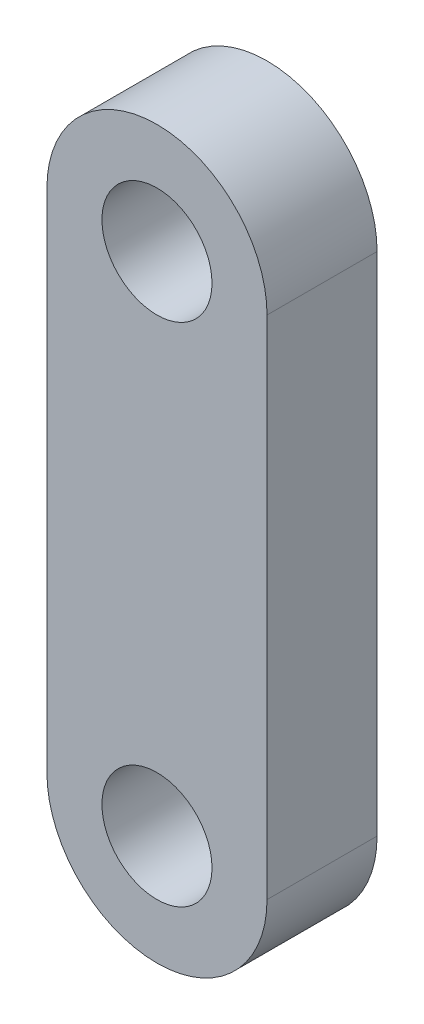
ISO-10303-21;
HEADER;
FILE_DESCRIPTION(('STEP AP214'),'2;1');
FILE_NAME('part.step','',(''),(''),'','','');
FILE_SCHEMA(('AUTOMOTIVE_DESIGN { 1 0 10303 214 1 1 1 1 }'));
ENDSEC;
DATA;
#1=APPLICATION_CONTEXT('core data for automotive mechanical design processes');
#2=APPLICATION_PROTOCOL_DEFINITION('international standard','automotive_design',2000,#1);
#3=PRODUCT_CONTEXT('',#1,'mechanical');
#4=PRODUCT('Part','Part','',(#3));
#5=PRODUCT_RELATED_PRODUCT_CATEGORY('part','',(#4));
#6=PRODUCT_DEFINITION_FORMATION('','',#4);
#7=PRODUCT_DEFINITION_CONTEXT('part definition',#1,'design');
#8=PRODUCT_DEFINITION('design','',#6,#7);
#9=PRODUCT_DEFINITION_SHAPE('','',#8);
#10=(LENGTH_UNIT() NAMED_UNIT(*) SI_UNIT(.MILLI.,.METRE.));
#11=(NAMED_UNIT(*) PLANE_ANGLE_UNIT() SI_UNIT($,.RADIAN.));
#12=(NAMED_UNIT(*) SI_UNIT($,.STERADIAN.) SOLID_ANGLE_UNIT());
#13=UNCERTAINTY_MEASURE_WITH_UNIT(LENGTH_MEASURE(1.E-05),#10,'distance_accuracy_value','');
#14=(GEOMETRIC_REPRESENTATION_CONTEXT(3) GLOBAL_UNCERTAINTY_ASSIGNED_CONTEXT((#13)) GLOBAL_UNIT_ASSIGNED_CONTEXT((#10,
#11,#12)) REPRESENTATION_CONTEXT('',''));
#15=CARTESIAN_POINT('',(0.,0.,0.));
#16=DIRECTION('',(0.,0.,1.));
#17=DIRECTION('',(1.,0.,0.));
#18=AXIS2_PLACEMENT_3D('',#15,#16,#17);
#19=CARTESIAN_POINT('',(0.,0.,2.5));
#20=DIRECTION('',(0.,0.,-1.));
#21=DIRECTION('',(-1.,0.,0.));
#22=AXIS2_PLACEMENT_3D('',#19,#20,#21);
#23=PLANE('',#22);
#24=CARTESIAN_POINT('',(0.,0.,2.5));
#25=DIRECTION('',(0.,0.,1.));
#26=DIRECTION('',(-1.,0.,0.));
#27=AXIS2_PLACEMENT_3D('',#24,#25,#26);
#28=CIRCLE('',#27,5.);
#29=CARTESIAN_POINT('',(-5.,0.,2.5));
#30=VERTEX_POINT('',#29);
#31=CARTESIAN_POINT('',(5.,0.,2.5));
#32=VERTEX_POINT('',#31);
#33=EDGE_CURVE('E87',#30,#32,#28,.T.);
#34=ORIENTED_EDGE('',*,*,#33,.T.);
#35=DIRECTION('',(0.,1.,0.));
#36=VECTOR('',#35,1.);
#37=CARTESIAN_POINT('',(5.,0.,2.5));
#38=LINE('',#37,#36);
#39=CARTESIAN_POINT('',(5.,23.,2.5));
#40=VERTEX_POINT('',#39);
#41=EDGE_CURVE('E82',#32,#40,#38,.T.);
#42=ORIENTED_EDGE('',*,*,#41,.T.);
#43=CARTESIAN_POINT('',(0.,23.,2.5));
#44=DIRECTION('',(0.,0.,1.));
#45=DIRECTION('',(1.,0.,0.));
#46=AXIS2_PLACEMENT_3D('',#43,#44,#45);
#47=CIRCLE('',#46,5.);
#48=CARTESIAN_POINT('',(-5.,23.,2.5));
#49=VERTEX_POINT('',#48);
#50=EDGE_CURVE('E85',#40,#49,#47,.T.);
#51=ORIENTED_EDGE('',*,*,#50,.T.);
#52=DIRECTION('',(0.,-1.,0.));
#53=VECTOR('',#52,1.);
#54=CARTESIAN_POINT('',(-5.,0.,2.5));
#55=LINE('',#54,#53);
#56=EDGE_CURVE('E52',#49,#30,#55,.T.);
#57=ORIENTED_EDGE('',*,*,#56,.T.);
#58=EDGE_LOOP('',(#34,#42,#51,#57));
#59=FACE_BOUND('',#58,.T.);
#60=CARTESIAN_POINT('',(0.,0.,2.5));
#61=DIRECTION('',(0.,0.,1.));
#62=DIRECTION('',(1.,0.,0.));
#63=AXIS2_PLACEMENT_3D('',#60,#61,#62);
#64=CIRCLE('',#63,2.5);
#65=CARTESIAN_POINT('',(2.5,0.,2.5));
#66=VERTEX_POINT('',#65);
#67=EDGE_CURVE('E102',#66,#66,#64,.T.);
#68=ORIENTED_EDGE('',*,*,#67,.F.);
#69=EDGE_LOOP('',(#68));
#70=FACE_BOUND('',#69,.T.);
#71=CARTESIAN_POINT('',(0.,23.,2.5));
#72=DIRECTION('',(0.,0.,1.));
#73=DIRECTION('',(1.,0.,0.));
#74=AXIS2_PLACEMENT_3D('',#71,#72,#73);
#75=CIRCLE('',#74,2.5);
#76=CARTESIAN_POINT('',(2.5,23.,2.5));
#77=VERTEX_POINT('',#76);
#78=EDGE_CURVE('E117',#77,#77,#75,.T.);
#79=ORIENTED_EDGE('',*,*,#78,.F.);
#80=EDGE_LOOP('',(#79));
#81=FACE_BOUND('',#80,.T.);
#82=ADVANCED_FACE('F35',(#59,#70,#81),#23,.F.);
#83=CARTESIAN_POINT('',(0.,0.,-2.5));
#84=DIRECTION('',(0.,0.,-1.));
#85=DIRECTION('',(-1.,0.,0.));
#86=AXIS2_PLACEMENT_3D('',#83,#84,#85);
#87=PLANE('',#86);
#88=CARTESIAN_POINT('',(0.,0.,-2.5));
#89=DIRECTION('',(0.,0.,1.));
#90=DIRECTION('',(1.,0.,0.));
#91=AXIS2_PLACEMENT_3D('',#88,#89,#90);
#92=CIRCLE('',#91,2.5);
#93=CARTESIAN_POINT('',(2.5,0.,-2.5));
#94=VERTEX_POINT('',#93);
#95=EDGE_CURVE('E114',#94,#94,#92,.T.);
#96=ORIENTED_EDGE('',*,*,#95,.T.);
#97=EDGE_LOOP('',(#96));
#98=FACE_BOUND('',#97,.T.);
#99=CARTESIAN_POINT('',(0.,0.,-2.5));
#100=DIRECTION('',(0.,0.,1.));
#101=DIRECTION('',(-1.,0.,0.));
#102=AXIS2_PLACEMENT_3D('',#99,#100,#101);
#103=CIRCLE('',#102,5.);
#104=CARTESIAN_POINT('',(-5.,0.,-2.5));
#105=VERTEX_POINT('',#104);
#106=CARTESIAN_POINT('',(5.,0.,-2.5));
#107=VERTEX_POINT('',#106);
#108=EDGE_CURVE('E99',#105,#107,#103,.T.);
#109=ORIENTED_EDGE('',*,*,#108,.F.);
#110=DIRECTION('',(0.,-1.,0.));
#111=VECTOR('',#110,1.);
#112=CARTESIAN_POINT('',(-5.,0.,-2.5));
#113=LINE('',#112,#111);
#114=CARTESIAN_POINT('',(-5.,23.,-2.5));
#115=VERTEX_POINT('',#114);
#116=EDGE_CURVE('E75',#115,#105,#113,.T.);
#117=ORIENTED_EDGE('',*,*,#116,.F.);
#118=CARTESIAN_POINT('',(0.,23.,-2.5));
#119=DIRECTION('',(0.,0.,1.));
#120=DIRECTION('',(1.,0.,0.));
#121=AXIS2_PLACEMENT_3D('',#118,#119,#120);
#122=CIRCLE('',#121,5.);
#123=CARTESIAN_POINT('',(5.,23.,-2.5));
#124=VERTEX_POINT('',#123);
#125=EDGE_CURVE('E69',#124,#115,#122,.T.);
#126=ORIENTED_EDGE('',*,*,#125,.F.);
#127=DIRECTION('',(0.,1.,0.));
#128=VECTOR('',#127,1.);
#129=CARTESIAN_POINT('',(5.,0.,-2.5));
#130=LINE('',#129,#128);
#131=EDGE_CURVE('E91',#107,#124,#130,.T.);
#132=ORIENTED_EDGE('',*,*,#131,.F.);
#133=EDGE_LOOP('',(#109,#117,#126,#132));
#134=FACE_BOUND('',#133,.T.);
#135=CARTESIAN_POINT('',(0.,23.,-2.5));
#136=DIRECTION('',(0.,0.,1.));
#137=DIRECTION('',(1.,0.,0.));
#138=AXIS2_PLACEMENT_3D('',#135,#136,#137);
#139=CIRCLE('',#138,2.5);
#140=CARTESIAN_POINT('',(2.5,23.,-2.5));
#141=VERTEX_POINT('',#140);
#142=EDGE_CURVE('E120',#141,#141,#139,.T.);
#143=ORIENTED_EDGE('',*,*,#142,.T.);
#144=EDGE_LOOP('',(#143));
#145=FACE_BOUND('',#144,.T.);
#146=ADVANCED_FACE('F110',(#98,#134,#145),#87,.T.);
#147=CARTESIAN_POINT('',(0.,0.,2.5));
#148=DIRECTION('',(0.,0.,-1.));
#149=DIRECTION('',(-1.,0.,0.));
#150=AXIS2_PLACEMENT_3D('',#147,#148,#149);
#151=CYLINDRICAL_SURFACE('',#150,5.);
#152=ORIENTED_EDGE('',*,*,#108,.T.);
#153=DIRECTION('',(0.,0.,-1.));
#154=VECTOR('',#153,1.);
#155=CARTESIAN_POINT('',(5.,0.,2.5));
#156=LINE('',#155,#154);
#157=EDGE_CURVE('E11',#32,#107,#156,.T.);
#158=ORIENTED_EDGE('',*,*,#157,.F.);
#159=ORIENTED_EDGE('',*,*,#33,.F.);
#160=DIRECTION('',(0.,0.,-1.));
#161=VECTOR('',#160,1.);
#162=CARTESIAN_POINT('',(-5.,0.,2.5));
#163=LINE('',#162,#161);
#164=EDGE_CURVE('E95',#30,#105,#163,.T.);
#165=ORIENTED_EDGE('',*,*,#164,.T.);
#166=EDGE_LOOP('',(#152,#158,#159,#165));
#167=FACE_BOUND('',#166,.T.);
#168=ADVANCED_FACE('F37',(#167),#151,.T.);
#169=CARTESIAN_POINT('',(5.,0.,2.5));
#170=DIRECTION('',(-1.,0.,0.));
#171=DIRECTION('',(0.,0.,1.));
#172=AXIS2_PLACEMENT_3D('',#169,#170,#171);
#173=PLANE('',#172);
#174=ORIENTED_EDGE('',*,*,#131,.T.);
#175=DIRECTION('',(0.,0.,-1.));
#176=VECTOR('',#175,1.);
#177=CARTESIAN_POINT('',(5.,23.,2.5));
#178=LINE('',#177,#176);
#179=EDGE_CURVE('E44',#40,#124,#178,.T.);
#180=ORIENTED_EDGE('',*,*,#179,.F.);
#181=ORIENTED_EDGE('',*,*,#41,.F.);
#182=ORIENTED_EDGE('',*,*,#157,.T.);
#183=EDGE_LOOP('',(#174,#180,#181,#182));
#184=FACE_BOUND('',#183,.T.);
#185=ADVANCED_FACE('F90',(#184),#173,.F.);
#186=CARTESIAN_POINT('',(0.,23.,2.5));
#187=DIRECTION('',(0.,0.,-1.));
#188=DIRECTION('',(-1.,0.,0.));
#189=AXIS2_PLACEMENT_3D('',#186,#187,#188);
#190=CYLINDRICAL_SURFACE('',#189,5.);
#191=ORIENTED_EDGE('',*,*,#125,.T.);
#192=DIRECTION('',(0.,0.,-1.));
#193=VECTOR('',#192,1.);
#194=CARTESIAN_POINT('',(-5.,23.,2.5));
#195=LINE('',#194,#193);
#196=EDGE_CURVE('E92',#49,#115,#195,.T.);
#197=ORIENTED_EDGE('',*,*,#196,.F.);
#198=ORIENTED_EDGE('',*,*,#50,.F.);
#199=ORIENTED_EDGE('',*,*,#179,.T.);
#200=EDGE_LOOP('',(#191,#197,#198,#199));
#201=FACE_BOUND('',#200,.T.);
#202=ADVANCED_FACE('F93',(#201),#190,.T.);
#203=CARTESIAN_POINT('',(-5.,0.,2.5));
#204=DIRECTION('',(1.,0.,0.));
#205=DIRECTION('',(0.,0.,-1.));
#206=AXIS2_PLACEMENT_3D('',#203,#204,#205);
#207=PLANE('',#206);
#208=ORIENTED_EDGE('',*,*,#116,.T.);
#209=ORIENTED_EDGE('',*,*,#164,.F.);
#210=ORIENTED_EDGE('',*,*,#56,.F.);
#211=ORIENTED_EDGE('',*,*,#196,.T.);
#212=EDGE_LOOP('',(#208,#209,#210,#211));
#213=FACE_BOUND('',#212,.T.);
#214=ADVANCED_FACE('F107',(#213),#207,.F.);
#215=CARTESIAN_POINT('',(0.,0.,2.5));
#216=DIRECTION('',(0.,0.,-1.));
#217=DIRECTION('',(-1.,0.,0.));
#218=AXIS2_PLACEMENT_3D('',#215,#216,#217);
#219=CYLINDRICAL_SURFACE('',#218,2.5);
#220=ORIENTED_EDGE('',*,*,#67,.T.);
#221=EDGE_LOOP('',(#220));
#222=FACE_BOUND('',#221,.T.);
#223=ORIENTED_EDGE('',*,*,#95,.F.);
#224=EDGE_LOOP('',(#223));
#225=FACE_BOUND('',#224,.T.);
#226=ADVANCED_FACE('F137',(#222,#225),#219,.F.);
#227=CARTESIAN_POINT('',(0.,23.,2.5));
#228=DIRECTION('',(0.,0.,-1.));
#229=DIRECTION('',(-1.,0.,0.));
#230=AXIS2_PLACEMENT_3D('',#227,#228,#229);
#231=CYLINDRICAL_SURFACE('',#230,2.5);
#232=ORIENTED_EDGE('',*,*,#78,.T.);
#233=EDGE_LOOP('',(#232));
#234=FACE_BOUND('',#233,.T.);
#235=ORIENTED_EDGE('',*,*,#142,.F.);
#236=EDGE_LOOP('',(#235));
#237=FACE_BOUND('',#236,.T.);
#238=ADVANCED_FACE('F126',(#234,#237),#231,.F.);
#239=CLOSED_SHELL('',(#82,#146,#168,#185,#202,#214,#226,#238));
#240=MANIFOLD_SOLID_BREP('B2',#239);
#241=ADVANCED_BREP_SHAPE_REPRESENTATION('',(#18,#240),#14);
#242=SHAPE_DEFINITION_REPRESENTATION(#9,#241);
ENDSEC;
END-ISO-10303-21;
